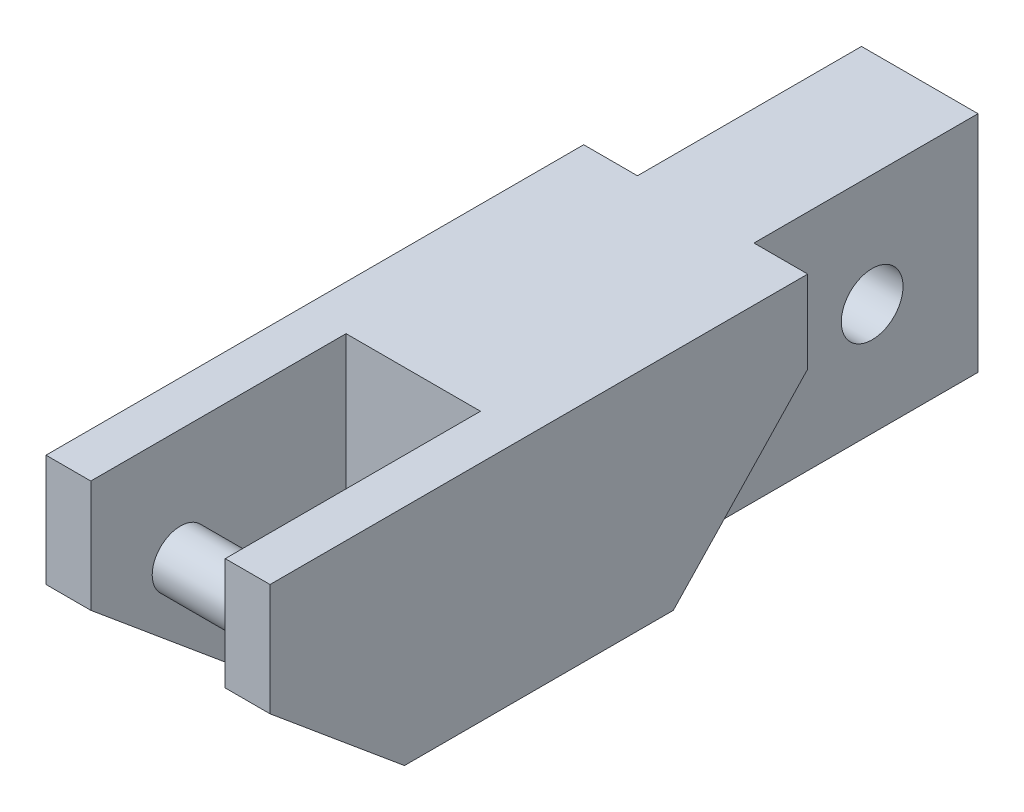
ISO-10303-21;
HEADER;
FILE_DESCRIPTION(('STEP AP214'),'2;1');
FILE_NAME('part.step','',(''),(''),'','','');
FILE_SCHEMA(('AUTOMOTIVE_DESIGN { 1 0 10303 214 1 1 1 1 }'));
ENDSEC;
DATA;
#1=APPLICATION_CONTEXT('core data for automotive mechanical design processes');
#2=APPLICATION_PROTOCOL_DEFINITION('international standard','automotive_design',2000,#1);
#3=PRODUCT_CONTEXT('',#1,'mechanical');
#4=PRODUCT('Part','Part','',(#3));
#5=PRODUCT_RELATED_PRODUCT_CATEGORY('part','',(#4));
#6=PRODUCT_DEFINITION_FORMATION('','',#4);
#7=PRODUCT_DEFINITION_CONTEXT('part definition',#1,'design');
#8=PRODUCT_DEFINITION('design','',#6,#7);
#9=PRODUCT_DEFINITION_SHAPE('','',#8);
#10=(LENGTH_UNIT() NAMED_UNIT(*) SI_UNIT(.MILLI.,.METRE.));
#11=(NAMED_UNIT(*) PLANE_ANGLE_UNIT() SI_UNIT($,.RADIAN.));
#12=(NAMED_UNIT(*) SI_UNIT($,.STERADIAN.) SOLID_ANGLE_UNIT());
#13=UNCERTAINTY_MEASURE_WITH_UNIT(LENGTH_MEASURE(1.E-05),#10,'distance_accuracy_value','');
#14=(GEOMETRIC_REPRESENTATION_CONTEXT(3) GLOBAL_UNCERTAINTY_ASSIGNED_CONTEXT((#13)) GLOBAL_UNIT_ASSIGNED_CONTEXT((#10,
#11,#12)) REPRESENTATION_CONTEXT('',''));
#15=CARTESIAN_POINT('',(0.,0.,0.));
#16=DIRECTION('',(0.,0.,1.));
#17=DIRECTION('',(1.,0.,0.));
#18=AXIS2_PLACEMENT_3D('',#15,#16,#17);
#19=CARTESIAN_POINT('',(-31.2781796503859,12.7,0.));
#20=DIRECTION('',(1.,0.,0.));
#21=DIRECTION('',(0.,0.,-1.));
#22=AXIS2_PLACEMENT_3D('',#19,#20,#21);
#23=PLANE('',#22);
#24=DIRECTION('',(0.,0.,1.));
#25=VECTOR('',#24,1.);
#26=CARTESIAN_POINT('',(-31.2781796503859,0.,0.));
#27=LINE('',#26,#25);
#28=CARTESIAN_POINT('',(-31.2781796503859,0.,-12.0241961802651));
#29=VERTEX_POINT('',#28);
#30=CARTESIAN_POINT('',(-31.2781796503859,0.,10.8358038197349));
#31=VERTEX_POINT('',#30);
#32=EDGE_CURVE('E301',#29,#31,#27,.T.);
#33=ORIENTED_EDGE('',*,*,#32,.T.);
#34=DIRECTION('',(0.,0.64018439966448,0.768221279597376));
#35=VECTOR('',#34,1.);
#36=CARTESIAN_POINT('',(-31.2781796503859,6.35,18.4558038197349));
#37=LINE('',#36,#35);
#38=CARTESIAN_POINT('',(-31.2781796503859,6.35,18.4558038197349));
#39=VERTEX_POINT('',#38);
#40=EDGE_CURVE('E266',#31,#39,#37,.T.);
#41=ORIENTED_EDGE('',*,*,#40,.T.);
#42=DIRECTION('',(0.,-1.,0.));
#43=VECTOR('',#42,1.);
#44=CARTESIAN_POINT('',(-31.2781796503859,12.7,18.4558038197349));
#45=LINE('',#44,#43);
#46=CARTESIAN_POINT('',(-31.2781796503859,12.7,18.4558038197349));
#47=VERTEX_POINT('',#46);
#48=EDGE_CURVE('E412',#47,#39,#45,.T.);
#49=ORIENTED_EDGE('',*,*,#48,.F.);
#50=DIRECTION('',(0.,0.,1.));
#51=VECTOR('',#50,1.);
#52=CARTESIAN_POINT('',(-31.2781796503859,12.7,0.));
#53=LINE('',#52,#51);
#54=CARTESIAN_POINT('',(-31.2781796503859,12.7,-12.0241961802651));
#55=VERTEX_POINT('',#54);
#56=EDGE_CURVE('E302',#55,#47,#53,.T.);
#57=ORIENTED_EDGE('',*,*,#56,.F.);
#58=DIRECTION('',(0.,-1.,0.));
#59=VECTOR('',#58,1.);
#60=CARTESIAN_POINT('',(-31.2781796503859,12.7,-12.0241961802651));
#61=LINE('',#60,#59);
#62=EDGE_CURVE('E371',#55,#29,#61,.T.);
#63=ORIENTED_EDGE('',*,*,#62,.T.);
#64=EDGE_LOOP('',(#33,#41,#49,#57,#63));
#65=FACE_BOUND('',#64,.T.);
#66=ADVANCED_FACE('F49',(#65),#23,.F.);
#67=CARTESIAN_POINT('',(0.,12.7,18.4558038197349));
#68=DIRECTION('',(0.,0.,-1.));
#69=DIRECTION('',(-1.,0.,0.));
#70=AXIS2_PLACEMENT_3D('',#67,#68,#69);
#71=PLANE('',#70);
#72=ORIENTED_EDGE('',*,*,#48,.T.);
#73=DIRECTION('',(1.,0.,0.));
#74=VECTOR('',#73,1.);
#75=CARTESIAN_POINT('',(-31.2781796503859,6.35,18.4558038197349));
#76=LINE('',#75,#74);
#77=CARTESIAN_POINT('',(-28.7381796503859,6.35,18.4558038197349));
#78=VERTEX_POINT('',#77);
#79=EDGE_CURVE('E273',#39,#78,#76,.T.);
#80=ORIENTED_EDGE('',*,*,#79,.T.);
#81=DIRECTION('',(0.,-1.,0.));
#82=VECTOR('',#81,1.);
#83=CARTESIAN_POINT('',(-28.7381796503859,12.7,18.4558038197349));
#84=LINE('',#83,#82);
#85=CARTESIAN_POINT('',(-28.7381796503859,12.7,18.4558038197349));
#86=VERTEX_POINT('',#85);
#87=EDGE_CURVE('E408',#86,#78,#84,.T.);
#88=ORIENTED_EDGE('',*,*,#87,.F.);
#89=DIRECTION('',(1.,0.,0.));
#90=VECTOR('',#89,1.);
#91=CARTESIAN_POINT('',(0.,12.7,18.4558038197349));
#92=LINE('',#91,#90);
#93=EDGE_CURVE('E306',#47,#86,#92,.T.);
#94=ORIENTED_EDGE('',*,*,#93,.F.);
#95=EDGE_LOOP('',(#72,#80,#88,#94));
#96=FACE_BOUND('',#95,.T.);
#97=ADVANCED_FACE('F486',(#96),#71,.F.);
#98=CARTESIAN_POINT('',(-28.7381796503859,12.7,0.));
#99=DIRECTION('',(-1.,0.,0.));
#100=DIRECTION('',(0.,0.,1.));
#101=AXIS2_PLACEMENT_3D('',#98,#99,#100);
#102=PLANE('',#101);
#103=CARTESIAN_POINT('',(-28.7381796503859,6.35,13.3758038197349));
#104=DIRECTION('',(-1.,0.,0.));
#105=DIRECTION('',(0.,0.,1.));
#106=AXIS2_PLACEMENT_3D('',#103,#104,#105);
#107=CIRCLE('',#106,1.6);
#108=CARTESIAN_POINT('',(-28.7381796503859,6.35,14.9758038197349));
#109=VERTEX_POINT('',#108);
#110=EDGE_CURVE('E292',#109,#109,#107,.T.);
#111=ORIENTED_EDGE('',*,*,#110,.T.);
#112=EDGE_LOOP('',(#111));
#113=FACE_BOUND('',#112,.T.);
#114=ORIENTED_EDGE('',*,*,#87,.T.);
#115=DIRECTION('',(0.,-0.64018439966448,-0.768221279597376));
#116=VECTOR('',#115,1.);
#117=CARTESIAN_POINT('',(-28.7381796503859,-0.124165812984396,10.6868048441537));
#118=LINE('',#117,#116);
#119=CARTESIAN_POINT('',(-28.7381796503859,0.,10.8358038197349));
#120=VERTEX_POINT('',#119);
#121=EDGE_CURVE('E284',#78,#120,#118,.T.);
#122=ORIENTED_EDGE('',*,*,#121,.T.);
#123=DIRECTION('',(0.,0.,-1.));
#124=VECTOR('',#123,1.);
#125=CARTESIAN_POINT('',(-28.7381796503859,0.,0.));
#126=LINE('',#125,#124);
#127=CARTESIAN_POINT('',(-28.7381796503859,0.,3.98580381973494));
#128=VERTEX_POINT('',#127);
#129=EDGE_CURVE('E345',#120,#128,#126,.T.);
#130=ORIENTED_EDGE('',*,*,#129,.T.);
#131=DIRECTION('',(0.,-1.,0.));
#132=VECTOR('',#131,1.);
#133=CARTESIAN_POINT('',(-28.7381796503859,12.7,3.98580381973494));
#134=LINE('',#133,#132);
#135=CARTESIAN_POINT('',(-28.7381796503859,12.7,3.98580381973494));
#136=VERTEX_POINT('',#135);
#137=EDGE_CURVE('E404',#136,#128,#134,.T.);
#138=ORIENTED_EDGE('',*,*,#137,.F.);
#139=DIRECTION('',(0.,0.,-1.));
#140=VECTOR('',#139,1.);
#141=CARTESIAN_POINT('',(-28.7381796503859,12.7,0.));
#142=LINE('',#141,#140);
#143=EDGE_CURVE('E310',#86,#136,#142,.T.);
#144=ORIENTED_EDGE('',*,*,#143,.F.);
#145=EDGE_LOOP('',(#114,#122,#130,#138,#144));
#146=FACE_BOUND('',#145,.T.);
#147=ADVANCED_FACE('F493',(#113,#146),#102,.F.);
#148=CARTESIAN_POINT('',(0.,12.7,3.98580381973494));
#149=DIRECTION('',(0.,0.,-1.));
#150=DIRECTION('',(-1.,0.,0.));
#151=AXIS2_PLACEMENT_3D('',#148,#149,#150);
#152=PLANE('',#151);
#153=DIRECTION('',(1.,0.,0.));
#154=VECTOR('',#153,1.);
#155=CARTESIAN_POINT('',(0.,0.,3.98580381973494));
#156=LINE('',#155,#154);
#157=CARTESIAN_POINT('',(-21.1181796503859,0.,3.98580381973494));
#158=VERTEX_POINT('',#157);
#159=EDGE_CURVE('E348',#128,#158,#156,.T.);
#160=ORIENTED_EDGE('',*,*,#159,.T.);
#161=DIRECTION('',(0.,-1.,0.));
#162=VECTOR('',#161,1.);
#163=CARTESIAN_POINT('',(-21.1181796503859,12.7,3.98580381973494));
#164=LINE('',#163,#162);
#165=CARTESIAN_POINT('',(-21.1181796503859,12.7,3.98580381973494));
#166=VERTEX_POINT('',#165);
#167=EDGE_CURVE('E400',#166,#158,#164,.T.);
#168=ORIENTED_EDGE('',*,*,#167,.F.);
#169=DIRECTION('',(1.,0.,0.));
#170=VECTOR('',#169,1.);
#171=CARTESIAN_POINT('',(0.,12.7,3.98580381973494));
#172=LINE('',#171,#170);
#173=EDGE_CURVE('E313',#136,#166,#172,.T.);
#174=ORIENTED_EDGE('',*,*,#173,.F.);
#175=ORIENTED_EDGE('',*,*,#137,.T.);
#176=EDGE_LOOP('',(#160,#168,#174,#175));
#177=FACE_BOUND('',#176,.T.);
#178=DIRECTION('',(0.,-1.,0.));
#179=VECTOR('',#178,1.);
#180=CARTESIAN_POINT('',(-24.1281796503859,3.175,3.98580381973494));
#181=LINE('',#180,#179);
#182=CARTESIAN_POINT('',(-24.1281796503859,3.175,3.98580381973494));
#183=VERTEX_POINT('',#182);
#184=CARTESIAN_POINT('',(-24.1281796503859,1.5875,3.98580381973494));
#185=VERTEX_POINT('',#184);
#186=EDGE_CURVE('E244',#183,#185,#181,.T.);
#187=ORIENTED_EDGE('',*,*,#186,.T.);
#188=DIRECTION('',(-1.,0.,0.));
#189=VECTOR('',#188,1.);
#190=CARTESIAN_POINT('',(-25.7281796503859,1.5875,3.98580381973494));
#191=LINE('',#190,#189);
#192=CARTESIAN_POINT('',(-25.7281796503859,1.5875,3.98580381973494));
#193=VERTEX_POINT('',#192);
#194=EDGE_CURVE('E210',#185,#193,#191,.T.);
#195=ORIENTED_EDGE('',*,*,#194,.T.);
#196=DIRECTION('',(0.,-1.,0.));
#197=VECTOR('',#196,1.);
#198=CARTESIAN_POINT('',(-25.7281796503859,3.175,3.98580381973494));
#199=LINE('',#198,#197);
#200=CARTESIAN_POINT('',(-25.7281796503859,3.175,3.98580381973494));
#201=VERTEX_POINT('',#200);
#202=EDGE_CURVE('E69',#201,#193,#199,.T.);
#203=ORIENTED_EDGE('',*,*,#202,.F.);
#204=DIRECTION('',(-1.,0.,0.));
#205=VECTOR('',#204,1.);
#206=CARTESIAN_POINT('',(-25.7281796503859,3.175,3.98580381973494));
#207=LINE('',#206,#205);
#208=EDGE_CURVE('E234',#183,#201,#207,.T.);
#209=ORIENTED_EDGE('',*,*,#208,.F.);
#210=EDGE_LOOP('',(#187,#195,#203,#209));
#211=FACE_BOUND('',#210,.T.);
#212=ADVANCED_FACE('F431',(#177,#211),#152,.F.);
#213=CARTESIAN_POINT('',(-21.1181796503859,12.7,0.));
#214=DIRECTION('',(1.,0.,0.));
#215=DIRECTION('',(0.,0.,-1.));
#216=AXIS2_PLACEMENT_3D('',#213,#214,#215);
#217=PLANE('',#216);
#218=CARTESIAN_POINT('',(-21.1181796503859,6.35,13.3758038197349));
#219=DIRECTION('',(1.,0.,0.));
#220=DIRECTION('',(0.,0.,-1.));
#221=AXIS2_PLACEMENT_3D('',#218,#219,#220);
#222=CIRCLE('',#221,1.6);
#223=CARTESIAN_POINT('',(-21.1181796503859,6.35,11.7758038197349));
#224=VERTEX_POINT('',#223);
#225=EDGE_CURVE('E288',#224,#224,#222,.T.);
#226=ORIENTED_EDGE('',*,*,#225,.T.);
#227=EDGE_LOOP('',(#226));
#228=FACE_BOUND('',#227,.T.);
#229=DIRECTION('',(0.,0.,1.));
#230=VECTOR('',#229,1.);
#231=CARTESIAN_POINT('',(-21.1181796503859,0.,0.));
#232=LINE('',#231,#230);
#233=CARTESIAN_POINT('',(-21.1181796503859,0.,10.8358038197349));
#234=VERTEX_POINT('',#233);
#235=EDGE_CURVE('E351',#158,#234,#232,.T.);
#236=ORIENTED_EDGE('',*,*,#235,.T.);
#237=DIRECTION('',(0.,0.64018439966448,0.768221279597376));
#238=VECTOR('',#237,1.);
#239=CARTESIAN_POINT('',(-21.1181796503859,-0.124165812984396,10.6868048441537));
#240=LINE('',#239,#238);
#241=CARTESIAN_POINT('',(-21.1181796503859,6.35,18.4558038197349));
#242=VERTEX_POINT('',#241);
#243=EDGE_CURVE('E277',#234,#242,#240,.T.);
#244=ORIENTED_EDGE('',*,*,#243,.T.);
#245=DIRECTION('',(0.,-1.,0.));
#246=VECTOR('',#245,1.);
#247=CARTESIAN_POINT('',(-21.1181796503859,12.7,18.4558038197349));
#248=LINE('',#247,#246);
#249=CARTESIAN_POINT('',(-21.1181796503859,12.7,18.4558038197349));
#250=VERTEX_POINT('',#249);
#251=EDGE_CURVE('E396',#250,#242,#248,.T.);
#252=ORIENTED_EDGE('',*,*,#251,.F.);
#253=DIRECTION('',(0.,0.,1.));
#254=VECTOR('',#253,1.);
#255=CARTESIAN_POINT('',(-21.1181796503859,12.7,0.));
#256=LINE('',#255,#254);
#257=EDGE_CURVE('E316',#166,#250,#256,.T.);
#258=ORIENTED_EDGE('',*,*,#257,.F.);
#259=ORIENTED_EDGE('',*,*,#167,.T.);
#260=EDGE_LOOP('',(#236,#244,#252,#258,#259));
#261=FACE_BOUND('',#260,.T.);
#262=ADVANCED_FACE('F498',(#228,#261),#217,.F.);
#263=CARTESIAN_POINT('',(0.,12.7,18.4558038197349));
#264=DIRECTION('',(0.,0.,-1.));
#265=DIRECTION('',(-1.,0.,0.));
#266=AXIS2_PLACEMENT_3D('',#263,#264,#265);
#267=PLANE('',#266);
#268=ORIENTED_EDGE('',*,*,#251,.T.);
#269=CARTESIAN_POINT('',(-18.5781796503859,6.35,18.4558038197349));
#270=VERTEX_POINT('',#269);
#271=EDGE_CURVE('E278',#242,#270,#76,.T.);
#272=ORIENTED_EDGE('',*,*,#271,.T.);
#273=DIRECTION('',(0.,-1.,0.));
#274=VECTOR('',#273,1.);
#275=CARTESIAN_POINT('',(-18.5781796503859,12.7,18.4558038197349));
#276=LINE('',#275,#274);
#277=CARTESIAN_POINT('',(-18.5781796503859,12.7,18.4558038197349));
#278=VERTEX_POINT('',#277);
#279=EDGE_CURVE('E392',#278,#270,#276,.T.);
#280=ORIENTED_EDGE('',*,*,#279,.F.);
#281=DIRECTION('',(1.,0.,0.));
#282=VECTOR('',#281,1.);
#283=CARTESIAN_POINT('',(0.,12.7,18.4558038197349));
#284=LINE('',#283,#282);
#285=EDGE_CURVE('E319',#250,#278,#284,.T.);
#286=ORIENTED_EDGE('',*,*,#285,.F.);
#287=EDGE_LOOP('',(#268,#272,#280,#286));
#288=FACE_BOUND('',#287,.T.);
#289=ADVANCED_FACE('F463',(#288),#267,.F.);
#290=CARTESIAN_POINT('',(-18.5781796503859,12.7,0.));
#291=DIRECTION('',(1.,0.,0.));
#292=DIRECTION('',(0.,0.,-1.));
#293=AXIS2_PLACEMENT_3D('',#290,#291,#292);
#294=PLANE('',#293);
#295=DIRECTION('',(0.,-0.725801798625511,0.687903880721699));
#296=VECTOR('',#295,1.);
#297=CARTESIAN_POINT('',(-18.5781796503859,8.039800124,-12.0241961802651));
#298=LINE('',#297,#296);
#299=CARTESIAN_POINT('',(-18.5781796503859,8.039800124,-12.0241961802651));
#300=VERTEX_POINT('',#299);
#301=CARTESIAN_POINT('',(-18.5781796503859,0.,-4.40419618026506));
#302=VERTEX_POINT('',#301);
#303=EDGE_CURVE('E243',#300,#302,#298,.T.);
#304=ORIENTED_EDGE('',*,*,#303,.F.);
#305=DIRECTION('',(0.,-1.,0.));
#306=VECTOR('',#305,1.);
#307=CARTESIAN_POINT('',(-18.5781796503859,12.7,-12.0241961802651));
#308=LINE('',#307,#306);
#309=CARTESIAN_POINT('',(-18.5781796503859,12.7,-12.0241961802651));
#310=VERTEX_POINT('',#309);
#311=EDGE_CURVE('E388',#310,#300,#308,.T.);
#312=ORIENTED_EDGE('',*,*,#311,.F.);
#313=DIRECTION('',(0.,0.,1.));
#314=VECTOR('',#313,1.);
#315=CARTESIAN_POINT('',(-18.5781796503859,12.7,0.));
#316=LINE('',#315,#314);
#317=EDGE_CURVE('E322',#310,#278,#316,.T.);
#318=ORIENTED_EDGE('',*,*,#317,.T.);
#319=ORIENTED_EDGE('',*,*,#279,.T.);
#320=DIRECTION('',(0.,0.64018439966448,0.768221279597376));
#321=VECTOR('',#320,1.);
#322=CARTESIAN_POINT('',(-18.5781796503859,6.35,18.4558038197349));
#323=LINE('',#322,#321);
#324=CARTESIAN_POINT('',(-18.5781796503859,0.,10.8358038197349));
#325=VERTEX_POINT('',#324);
#326=EDGE_CURVE('E265',#325,#270,#323,.T.);
#327=ORIENTED_EDGE('',*,*,#326,.F.);
#328=DIRECTION('',(0.,0.,1.));
#329=VECTOR('',#328,1.);
#330=CARTESIAN_POINT('',(-18.5781796503859,0.,0.));
#331=LINE('',#330,#329);
#332=EDGE_CURVE('E355',#302,#325,#331,.T.);
#333=ORIENTED_EDGE('',*,*,#332,.F.);
#334=EDGE_LOOP('',(#304,#312,#318,#319,#327,#333));
#335=FACE_BOUND('',#334,.T.);
#336=ADVANCED_FACE('F457',(#335),#294,.T.);
#337=CARTESIAN_POINT('',(0.,12.7,-12.0241961802651));
#338=DIRECTION('',(0.,0.,-1.));
#339=DIRECTION('',(-1.,0.,0.));
#340=AXIS2_PLACEMENT_3D('',#337,#338,#339);
#341=PLANE('',#340);
#342=DIRECTION('',(1.,0.,0.));
#343=VECTOR('',#342,1.);
#344=CARTESIAN_POINT('',(-32.7033086120741,8.039800124,-12.0241961802651));
#345=LINE('',#344,#343);
#346=CARTESIAN_POINT('',(-21.6261796503859,8.039800124,-12.0241961802651));
#347=VERTEX_POINT('',#346);
#348=EDGE_CURVE('E255',#347,#300,#345,.T.);
#349=ORIENTED_EDGE('',*,*,#348,.F.);
#350=DIRECTION('',(0.,-1.,0.));
#351=VECTOR('',#350,1.);
#352=CARTESIAN_POINT('',(-21.6261796503859,12.7,-12.0241961802651));
#353=LINE('',#352,#351);
#354=CARTESIAN_POINT('',(-21.6261796503859,12.7,-12.0241961802651));
#355=VERTEX_POINT('',#354);
#356=EDGE_CURVE('E384',#355,#347,#353,.T.);
#357=ORIENTED_EDGE('',*,*,#356,.F.);
#358=DIRECTION('',(1.,0.,0.));
#359=VECTOR('',#358,1.);
#360=CARTESIAN_POINT('',(0.,12.7,-12.0241961802651));
#361=LINE('',#360,#359);
#362=EDGE_CURVE('E326',#355,#310,#361,.T.);
#363=ORIENTED_EDGE('',*,*,#362,.T.);
#364=ORIENTED_EDGE('',*,*,#311,.T.);
#365=EDGE_LOOP('',(#349,#357,#363,#364));
#366=FACE_BOUND('',#365,.T.);
#367=ADVANCED_FACE('F502',(#366),#341,.T.);
#368=CARTESIAN_POINT('',(-21.6261796503859,12.7,0.));
#369=DIRECTION('',(1.,0.,0.));
#370=DIRECTION('',(0.,0.,-1.));
#371=AXIS2_PLACEMENT_3D('',#368,#369,#370);
#372=PLANE('',#371);
#373=CARTESIAN_POINT('',(-21.6261796503859,6.35,-18.7241961802651));
#374=DIRECTION('',(1.,0.,0.));
#375=DIRECTION('',(0.,0.,-1.));
#376=AXIS2_PLACEMENT_3D('',#373,#374,#375);
#377=CIRCLE('',#376,1.75);
#378=CARTESIAN_POINT('',(-21.6261796503859,6.35,-20.4741961802651));
#379=VERTEX_POINT('',#378);
#380=EDGE_CURVE('E297',#379,#379,#377,.T.);
#381=ORIENTED_EDGE('',*,*,#380,.F.);
#382=EDGE_LOOP('',(#381));
#383=FACE_BOUND('',#382,.T.);
#384=DIRECTION('',(0.,0.,1.));
#385=VECTOR('',#384,1.);
#386=CARTESIAN_POINT('',(-21.6261796503859,0.,0.));
#387=LINE('',#386,#385);
#388=CARTESIAN_POINT('',(-21.6261796503859,0.,-24.7241961802651));
#389=VERTEX_POINT('',#388);
#390=CARTESIAN_POINT('',(-21.6261796503859,0.,-4.40419618026506));
#391=VERTEX_POINT('',#390);
#392=EDGE_CURVE('E358',#389,#391,#387,.T.);
#393=ORIENTED_EDGE('',*,*,#392,.F.);
#394=DIRECTION('',(0.,-1.,0.));
#395=VECTOR('',#394,1.);
#396=CARTESIAN_POINT('',(-21.6261796503859,12.7,-24.7241961802651));
#397=LINE('',#396,#395);
#398=CARTESIAN_POINT('',(-21.6261796503859,12.7,-24.7241961802651));
#399=VERTEX_POINT('',#398);
#400=EDGE_CURVE('E380',#399,#389,#397,.T.);
#401=ORIENTED_EDGE('',*,*,#400,.F.);
#402=DIRECTION('',(0.,0.,1.));
#403=VECTOR('',#402,1.);
#404=CARTESIAN_POINT('',(-21.6261796503859,12.7,0.));
#405=LINE('',#404,#403);
#406=EDGE_CURVE('E330',#399,#355,#405,.T.);
#407=ORIENTED_EDGE('',*,*,#406,.T.);
#408=ORIENTED_EDGE('',*,*,#356,.T.);
#409=DIRECTION('',(0.,0.725801798625511,-0.687903880721699));
#410=VECTOR('',#409,1.);
#411=CARTESIAN_POINT('',(-21.6261796503859,8.039800124,-12.0241961802651));
#412=LINE('',#411,#410);
#413=EDGE_CURVE('E260',#391,#347,#412,.T.);
#414=ORIENTED_EDGE('',*,*,#413,.F.);
#415=EDGE_LOOP('',(#393,#401,#407,#408,#414));
#416=FACE_BOUND('',#415,.T.);
#417=ADVANCED_FACE('F447',(#383,#416),#372,.T.);
#418=CARTESIAN_POINT('',(0.,12.7,-24.7241961802651));
#419=DIRECTION('',(0.,0.,-1.));
#420=DIRECTION('',(-1.,0.,0.));
#421=AXIS2_PLACEMENT_3D('',#418,#419,#420);
#422=PLANE('',#421);
#423=DIRECTION('',(0.,-1.,0.));
#424=VECTOR('',#423,1.);
#425=CARTESIAN_POINT('',(-25.7281796503859,3.175,-24.7241961802651));
#426=LINE('',#425,#424);
#427=CARTESIAN_POINT('',(-25.7281796503859,3.175,-24.7241961802651));
#428=VERTEX_POINT('',#427);
#429=CARTESIAN_POINT('',(-25.7281796503859,0.,-24.7241961802651));
#430=VERTEX_POINT('',#429);
#431=EDGE_CURVE('E237',#428,#430,#426,.T.);
#432=ORIENTED_EDGE('',*,*,#431,.T.);
#433=DIRECTION('',(1.,0.,0.));
#434=VECTOR('',#433,1.);
#435=CARTESIAN_POINT('',(0.,0.,-24.7241961802651));
#436=LINE('',#435,#434);
#437=CARTESIAN_POINT('',(-28.2301796503859,0.,-24.7241961802651));
#438=VERTEX_POINT('',#437);
#439=EDGE_CURVE('E199',#438,#430,#436,.T.);
#440=ORIENTED_EDGE('',*,*,#439,.F.);
#441=DIRECTION('',(0.,-1.,0.));
#442=VECTOR('',#441,1.);
#443=CARTESIAN_POINT('',(-28.2301796503859,12.7,-24.7241961802651));
#444=LINE('',#443,#442);
#445=CARTESIAN_POINT('',(-28.2301796503859,12.7,-24.7241961802651));
#446=VERTEX_POINT('',#445);
#447=EDGE_CURVE('E377',#446,#438,#444,.T.);
#448=ORIENTED_EDGE('',*,*,#447,.F.);
#449=DIRECTION('',(1.,0.,0.));
#450=VECTOR('',#449,1.);
#451=CARTESIAN_POINT('',(0.,12.7,-24.7241961802651));
#452=LINE('',#451,#450);
#453=EDGE_CURVE('E335',#446,#399,#452,.T.);
#454=ORIENTED_EDGE('',*,*,#453,.T.);
#455=ORIENTED_EDGE('',*,*,#400,.T.);
#456=CARTESIAN_POINT('',(-24.1281796503859,0.,-24.7241961802651));
#457=VERTEX_POINT('',#456);
#458=EDGE_CURVE('E365',#457,#389,#436,.T.);
#459=ORIENTED_EDGE('',*,*,#458,.F.);
#460=DIRECTION('',(0.,-1.,0.));
#461=VECTOR('',#460,1.);
#462=CARTESIAN_POINT('',(-24.1281796503859,3.175,-24.7241961802651));
#463=LINE('',#462,#461);
#464=CARTESIAN_POINT('',(-24.1281796503859,3.175,-24.7241961802651));
#465=VERTEX_POINT('',#464);
#466=EDGE_CURVE('E248',#465,#457,#463,.T.);
#467=ORIENTED_EDGE('',*,*,#466,.F.);
#468=DIRECTION('',(1.,0.,0.));
#469=VECTOR('',#468,1.);
#470=CARTESIAN_POINT('',(-25.7281796503859,3.175,-24.7241961802651));
#471=LINE('',#470,#469);
#472=EDGE_CURVE('E226',#428,#465,#471,.T.);
#473=ORIENTED_EDGE('',*,*,#472,.F.);
#474=EDGE_LOOP('',(#432,#440,#448,#454,#455,#459,#467,#473));
#475=FACE_BOUND('',#474,.T.);
#476=ADVANCED_FACE('F440',(#475),#422,.T.);
#477=CARTESIAN_POINT('',(-28.2301796503859,12.7,0.));
#478=DIRECTION('',(1.,0.,0.));
#479=DIRECTION('',(0.,0.,-1.));
#480=AXIS2_PLACEMENT_3D('',#477,#478,#479);
#481=PLANE('',#480);
#482=CARTESIAN_POINT('',(-28.2301796503859,6.35,-18.7241961802651));
#483=DIRECTION('',(1.,0.,0.));
#484=DIRECTION('',(0.,0.,-1.));
#485=AXIS2_PLACEMENT_3D('',#482,#483,#484);
#486=CIRCLE('',#485,1.75);
#487=CARTESIAN_POINT('',(-28.2301796503859,6.35,-20.4741961802651));
#488=VERTEX_POINT('',#487);
#489=EDGE_CURVE('E296',#488,#488,#486,.T.);
#490=ORIENTED_EDGE('',*,*,#489,.T.);
#491=EDGE_LOOP('',(#490));
#492=FACE_BOUND('',#491,.T.);
#493=DIRECTION('',(0.,0.,1.));
#494=VECTOR('',#493,1.);
#495=CARTESIAN_POINT('',(-28.2301796503859,0.,0.));
#496=LINE('',#495,#494);
#497=CARTESIAN_POINT('',(-28.2301796503859,0.,-12.0241961802651));
#498=VERTEX_POINT('',#497);
#499=EDGE_CURVE('E362',#438,#498,#496,.T.);
#500=ORIENTED_EDGE('',*,*,#499,.T.);
#501=DIRECTION('',(0.,-1.,0.));
#502=VECTOR('',#501,1.);
#503=CARTESIAN_POINT('',(-28.2301796503859,12.7,-12.0241961802651));
#504=LINE('',#503,#502);
#505=CARTESIAN_POINT('',(-28.2301796503859,12.7,-12.0241961802651));
#506=VERTEX_POINT('',#505);
#507=EDGE_CURVE('E374',#506,#498,#504,.T.);
#508=ORIENTED_EDGE('',*,*,#507,.F.);
#509=DIRECTION('',(0.,0.,1.));
#510=VECTOR('',#509,1.);
#511=CARTESIAN_POINT('',(-28.2301796503859,12.7,0.));
#512=LINE('',#511,#510);
#513=EDGE_CURVE('E339',#446,#506,#512,.T.);
#514=ORIENTED_EDGE('',*,*,#513,.F.);
#515=ORIENTED_EDGE('',*,*,#447,.T.);
#516=EDGE_LOOP('',(#500,#508,#514,#515));
#517=FACE_BOUND('',#516,.T.);
#518=ADVANCED_FACE('F480',(#492,#517),#481,.F.);
#519=DIRECTION('',(1.,0.,0.));
#520=VECTOR('',#519,1.);
#521=CARTESIAN_POINT('',(0.,0.,-12.0241961802651));
#522=LINE('',#521,#520);
#523=EDGE_CURVE('E307',#29,#498,#522,.T.);
#524=ORIENTED_EDGE('',*,*,#523,.F.);
#525=ORIENTED_EDGE('',*,*,#62,.F.);
#526=EDGE_CURVE('E331',#55,#506,#361,.T.);
#527=ORIENTED_EDGE('',*,*,#526,.T.);
#528=ORIENTED_EDGE('',*,*,#507,.T.);
#529=EDGE_LOOP('',(#524,#525,#527,#528));
#530=FACE_BOUND('',#529,.T.);
#531=ADVANCED_FACE('F472',(#530),#341,.T.);
#532=CARTESIAN_POINT('',(0.,12.7,0.));
#533=DIRECTION('',(0.,1.,0.));
#534=DIRECTION('',(0.,0.,1.));
#535=AXIS2_PLACEMENT_3D('',#532,#533,#534);
#536=PLANE('',#535);
#537=ORIENTED_EDGE('',*,*,#56,.T.);
#538=ORIENTED_EDGE('',*,*,#93,.T.);
#539=ORIENTED_EDGE('',*,*,#143,.T.);
#540=ORIENTED_EDGE('',*,*,#173,.T.);
#541=ORIENTED_EDGE('',*,*,#257,.T.);
#542=ORIENTED_EDGE('',*,*,#285,.T.);
#543=ORIENTED_EDGE('',*,*,#317,.F.);
#544=ORIENTED_EDGE('',*,*,#362,.F.);
#545=ORIENTED_EDGE('',*,*,#406,.F.);
#546=ORIENTED_EDGE('',*,*,#453,.F.);
#547=ORIENTED_EDGE('',*,*,#513,.T.);
#548=ORIENTED_EDGE('',*,*,#526,.F.);
#549=EDGE_LOOP('',(#537,#538,#539,#540,#541,#542,#543,#544,#545,#546,#547,#548));
#550=FACE_BOUND('',#549,.T.);
#551=ADVANCED_FACE('F476',(#550),#536,.T.);
#552=CARTESIAN_POINT('',(0.,0.,0.));
#553=DIRECTION('',(0.,1.,0.));
#554=DIRECTION('',(0.,0.,1.));
#555=AXIS2_PLACEMENT_3D('',#552,#553,#554);
#556=PLANE('',#555);
#557=ORIENTED_EDGE('',*,*,#235,.F.);
#558=ORIENTED_EDGE('',*,*,#159,.F.);
#559=ORIENTED_EDGE('',*,*,#129,.F.);
#560=DIRECTION('',(1.,0.,0.));
#561=VECTOR('',#560,1.);
#562=CARTESIAN_POINT('',(-31.2781796503859,0.,10.8358038197349));
#563=LINE('',#562,#561);
#564=EDGE_CURVE('E270',#31,#120,#563,.T.);
#565=ORIENTED_EDGE('',*,*,#564,.F.);
#566=ORIENTED_EDGE('',*,*,#32,.F.);
#567=ORIENTED_EDGE('',*,*,#523,.T.);
#568=ORIENTED_EDGE('',*,*,#499,.F.);
#569=ORIENTED_EDGE('',*,*,#439,.T.);
#570=DIRECTION('',(0.,0.,-1.));
#571=VECTOR('',#570,1.);
#572=CARTESIAN_POINT('',(-25.7281796503859,0.,3.98580381973494));
#573=LINE('',#572,#571);
#574=CARTESIAN_POINT('',(-25.7281796503859,0.,-4.40419618026506));
#575=VERTEX_POINT('',#574);
#576=EDGE_CURVE('E191',#575,#430,#573,.T.);
#577=ORIENTED_EDGE('',*,*,#576,.F.);
#578=DIRECTION('',(1.,0.,0.));
#579=VECTOR('',#578,1.);
#580=CARTESIAN_POINT('',(-25.7281796503859,0.,-4.40419618026506));
#581=LINE('',#580,#579);
#582=CARTESIAN_POINT('',(-24.1281796503859,0.,-4.40419618026506));
#583=VERTEX_POINT('',#582);
#584=EDGE_CURVE('E196',#575,#583,#581,.T.);
#585=ORIENTED_EDGE('',*,*,#584,.T.);
#586=DIRECTION('',(0.,0.,1.));
#587=VECTOR('',#586,1.);
#588=CARTESIAN_POINT('',(-24.1281796503859,0.,3.98580381973494));
#589=LINE('',#588,#587);
#590=EDGE_CURVE('E202',#457,#583,#589,.T.);
#591=ORIENTED_EDGE('',*,*,#590,.F.);
#592=ORIENTED_EDGE('',*,*,#458,.T.);
#593=ORIENTED_EDGE('',*,*,#392,.T.);
#594=DIRECTION('',(1.,0.,0.));
#595=VECTOR('',#594,1.);
#596=CARTESIAN_POINT('',(-32.7033086120741,0.,-4.40419618026506));
#597=LINE('',#596,#595);
#598=EDGE_CURVE('E256',#391,#302,#597,.T.);
#599=ORIENTED_EDGE('',*,*,#598,.T.);
#600=ORIENTED_EDGE('',*,*,#332,.T.);
#601=DIRECTION('',(-1.,0.,0.));
#602=VECTOR('',#601,1.);
#603=CARTESIAN_POINT('',(0.,0.,10.8358038197349));
#604=LINE('',#603,#602);
#605=EDGE_CURVE('E416',#325,#234,#604,.T.);
#606=ORIENTED_EDGE('',*,*,#605,.T.);
#607=EDGE_LOOP('',(#557,#558,#559,#565,#566,#567,#568,#569,#577,#585,#591,#592,#593,#599,#600,#606));
#608=FACE_BOUND('',#607,.T.);
#609=ADVANCED_FACE('F193',(#608),#556,.F.);
#610=CARTESIAN_POINT('',(-31.2781796503859,6.35,-18.7241961802651));
#611=DIRECTION('',(1.,0.,0.));
#612=DIRECTION('',(0.,0.,-1.));
#613=AXIS2_PLACEMENT_3D('',#610,#611,#612);
#614=CYLINDRICAL_SURFACE('',#613,1.75);
#615=ORIENTED_EDGE('',*,*,#380,.T.);
#616=EDGE_LOOP('',(#615));
#617=FACE_BOUND('',#616,.T.);
#618=ORIENTED_EDGE('',*,*,#489,.F.);
#619=EDGE_LOOP('',(#618));
#620=FACE_BOUND('',#619,.T.);
#621=ADVANCED_FACE('F539',(#617,#620),#614,.F.);
#622=CARTESIAN_POINT('',(-31.2781796503859,6.35,13.3758038197349));
#623=DIRECTION('',(1.,0.,0.));
#624=DIRECTION('',(0.,0.,-1.));
#625=AXIS2_PLACEMENT_3D('',#622,#623,#624);
#626=CYLINDRICAL_SURFACE('',#625,1.6);
#627=ORIENTED_EDGE('',*,*,#225,.F.);
#628=EDGE_LOOP('',(#627));
#629=FACE_BOUND('',#628,.T.);
#630=ORIENTED_EDGE('',*,*,#110,.F.);
#631=EDGE_LOOP('',(#630));
#632=FACE_BOUND('',#631,.T.);
#633=ADVANCED_FACE('F541',(#629,#632),#626,.T.);
#634=CARTESIAN_POINT('',(-31.2781796503859,6.35,18.4558038197349));
#635=DIRECTION('',(0.,0.768221279597376,-0.64018439966448));
#636=DIRECTION('',(0.,0.64018439966448,0.768221279597376));
#637=AXIS2_PLACEMENT_3D('',#634,#635,#636);
#638=PLANE('',#637);
#639=ORIENTED_EDGE('',*,*,#79,.F.);
#640=ORIENTED_EDGE('',*,*,#40,.F.);
#641=ORIENTED_EDGE('',*,*,#564,.T.);
#642=ORIENTED_EDGE('',*,*,#121,.F.);
#643=EDGE_LOOP('',(#639,#640,#641,#642));
#644=FACE_BOUND('',#643,.T.);
#645=ADVANCED_FACE('F548',(#644),#638,.F.);
#646=ORIENTED_EDGE('',*,*,#605,.F.);
#647=ORIENTED_EDGE('',*,*,#326,.T.);
#648=ORIENTED_EDGE('',*,*,#271,.F.);
#649=ORIENTED_EDGE('',*,*,#243,.F.);
#650=EDGE_LOOP('',(#646,#647,#648,#649));
#651=FACE_BOUND('',#650,.T.);
#652=ADVANCED_FACE('F461',(#651),#638,.F.);
#653=CARTESIAN_POINT('',(-32.7033086120741,8.039800124,-12.0241961802651));
#654=DIRECTION('',(0.,0.687903880721699,0.725801798625511));
#655=DIRECTION('',(0.,-0.725801798625511,0.687903880721699));
#656=AXIS2_PLACEMENT_3D('',#653,#654,#655);
#657=PLANE('',#656);
#658=ORIENTED_EDGE('',*,*,#413,.T.);
#659=ORIENTED_EDGE('',*,*,#348,.T.);
#660=ORIENTED_EDGE('',*,*,#303,.T.);
#661=ORIENTED_EDGE('',*,*,#598,.F.);
#662=EDGE_LOOP('',(#658,#659,#660,#661));
#663=FACE_BOUND('',#662,.T.);
#664=ADVANCED_FACE('F451',(#663),#657,.F.);
#665=CARTESIAN_POINT('',(-25.7281796503859,3.175,3.98580381973494));
#666=DIRECTION('',(-1.,0.,0.));
#667=DIRECTION('',(0.,0.,1.));
#668=AXIS2_PLACEMENT_3D('',#665,#666,#667);
#669=PLANE('',#668);
#670=DIRECTION('',(0.,0.,-1.));
#671=VECTOR('',#670,1.);
#672=CARTESIAN_POINT('',(-25.7281796503859,1.5875,3.98580381973494));
#673=LINE('',#672,#671);
#674=CARTESIAN_POINT('',(-25.7281796503859,1.5875,-4.40419618026506));
#675=VERTEX_POINT('',#674);
#676=EDGE_CURVE('E64',#193,#675,#673,.T.);
#677=ORIENTED_EDGE('',*,*,#676,.T.);
#678=DIRECTION('',(0.,-1.,0.));
#679=VECTOR('',#678,1.);
#680=CARTESIAN_POINT('',(-25.7281796503859,1.5875,-4.40419618026506));
#681=LINE('',#680,#679);
#682=EDGE_CURVE('E203',#675,#575,#681,.T.);
#683=ORIENTED_EDGE('',*,*,#682,.T.);
#684=ORIENTED_EDGE('',*,*,#576,.T.);
#685=ORIENTED_EDGE('',*,*,#431,.F.);
#686=DIRECTION('',(0.,0.,-1.));
#687=VECTOR('',#686,1.);
#688=CARTESIAN_POINT('',(-25.7281796503859,3.175,3.98580381973494));
#689=LINE('',#688,#687);
#690=EDGE_CURVE('E222',#201,#428,#689,.T.);
#691=ORIENTED_EDGE('',*,*,#690,.F.);
#692=ORIENTED_EDGE('',*,*,#202,.T.);
#693=EDGE_LOOP('',(#677,#683,#684,#685,#691,#692));
#694=FACE_BOUND('',#693,.T.);
#695=ADVANCED_FACE('F205',(#694),#669,.F.);
#696=CARTESIAN_POINT('',(-24.1281796503859,3.175,3.98580381973494));
#697=DIRECTION('',(1.,0.,0.));
#698=DIRECTION('',(0.,0.,-1.));
#699=AXIS2_PLACEMENT_3D('',#696,#697,#698);
#700=PLANE('',#699);
#701=ORIENTED_EDGE('',*,*,#590,.T.);
#702=DIRECTION('',(0.,1.,0.));
#703=VECTOR('',#702,1.);
#704=CARTESIAN_POINT('',(-24.1281796503859,3.175,-4.40419618026506));
#705=LINE('',#704,#703);
#706=CARTESIAN_POINT('',(-24.1281796503859,1.5875,-4.40419618026506));
#707=VERTEX_POINT('',#706);
#708=EDGE_CURVE('E11',#583,#707,#705,.T.);
#709=ORIENTED_EDGE('',*,*,#708,.T.);
#710=DIRECTION('',(0.,0.,-1.));
#711=VECTOR('',#710,1.);
#712=CARTESIAN_POINT('',(-24.1281796503859,1.5875,3.98580381973494));
#713=LINE('',#712,#711);
#714=EDGE_CURVE('E57',#185,#707,#713,.T.);
#715=ORIENTED_EDGE('',*,*,#714,.F.);
#716=ORIENTED_EDGE('',*,*,#186,.F.);
#717=DIRECTION('',(0.,0.,1.));
#718=VECTOR('',#717,1.);
#719=CARTESIAN_POINT('',(-24.1281796503859,3.175,3.98580381973494));
#720=LINE('',#719,#718);
#721=EDGE_CURVE('E230',#465,#183,#720,.T.);
#722=ORIENTED_EDGE('',*,*,#721,.F.);
#723=ORIENTED_EDGE('',*,*,#466,.T.);
#724=EDGE_LOOP('',(#701,#709,#715,#716,#722,#723));
#725=FACE_BOUND('',#724,.T.);
#726=ADVANCED_FACE('F433',(#725),#700,.F.);
#727=CARTESIAN_POINT('',(0.,3.175,0.));
#728=DIRECTION('',(0.,-1.,0.));
#729=DIRECTION('',(0.,0.,-1.));
#730=AXIS2_PLACEMENT_3D('',#727,#728,#729);
#731=PLANE('',#730);
#732=ORIENTED_EDGE('',*,*,#690,.T.);
#733=ORIENTED_EDGE('',*,*,#472,.T.);
#734=ORIENTED_EDGE('',*,*,#721,.T.);
#735=ORIENTED_EDGE('',*,*,#208,.T.);
#736=EDGE_LOOP('',(#732,#733,#734,#735));
#737=FACE_BOUND('',#736,.T.);
#738=ADVANCED_FACE('F435',(#737),#731,.T.);
#739=CARTESIAN_POINT('',(-25.7281796503859,1.5875,-4.40419618026506));
#740=DIRECTION('',(0.,0.,-1.));
#741=DIRECTION('',(-1.,0.,0.));
#742=AXIS2_PLACEMENT_3D('',#739,#740,#741);
#743=PLANE('',#742);
#744=ORIENTED_EDGE('',*,*,#708,.F.);
#745=ORIENTED_EDGE('',*,*,#584,.F.);
#746=ORIENTED_EDGE('',*,*,#682,.F.);
#747=DIRECTION('',(1.,0.,0.));
#748=VECTOR('',#747,1.);
#749=CARTESIAN_POINT('',(-25.7281796503859,1.5875,-4.40419618026506));
#750=LINE('',#749,#748);
#751=EDGE_CURVE('E217',#675,#707,#750,.T.);
#752=ORIENTED_EDGE('',*,*,#751,.T.);
#753=EDGE_LOOP('',(#744,#745,#746,#752));
#754=FACE_BOUND('',#753,.T.);
#755=ADVANCED_FACE('F213',(#754),#743,.T.);
#756=CARTESIAN_POINT('',(0.,1.5875,0.));
#757=DIRECTION('',(0.,-1.,0.));
#758=DIRECTION('',(0.,0.,-1.));
#759=AXIS2_PLACEMENT_3D('',#756,#757,#758);
#760=PLANE('',#759);
#761=ORIENTED_EDGE('',*,*,#194,.F.);
#762=ORIENTED_EDGE('',*,*,#714,.T.);
#763=ORIENTED_EDGE('',*,*,#751,.F.);
#764=ORIENTED_EDGE('',*,*,#676,.F.);
#765=EDGE_LOOP('',(#761,#762,#763,#764));
#766=FACE_BOUND('',#765,.T.);
#767=ADVANCED_FACE('F426',(#766),#760,.F.);
#768=CLOSED_SHELL('',(#66,#97,#147,#212,#262,#289,#336,#367,#417,#476,#518,#531,#551,#609,#621,
#633,#645,#652,#664,#695,#726,#738,#755,#767));
#769=MANIFOLD_SOLID_BREP('B2',#768);
#770=ADVANCED_BREP_SHAPE_REPRESENTATION('',(#18,#769),#14);
#771=SHAPE_DEFINITION_REPRESENTATION(#9,#770);
ENDSEC;
END-ISO-10303-21;
